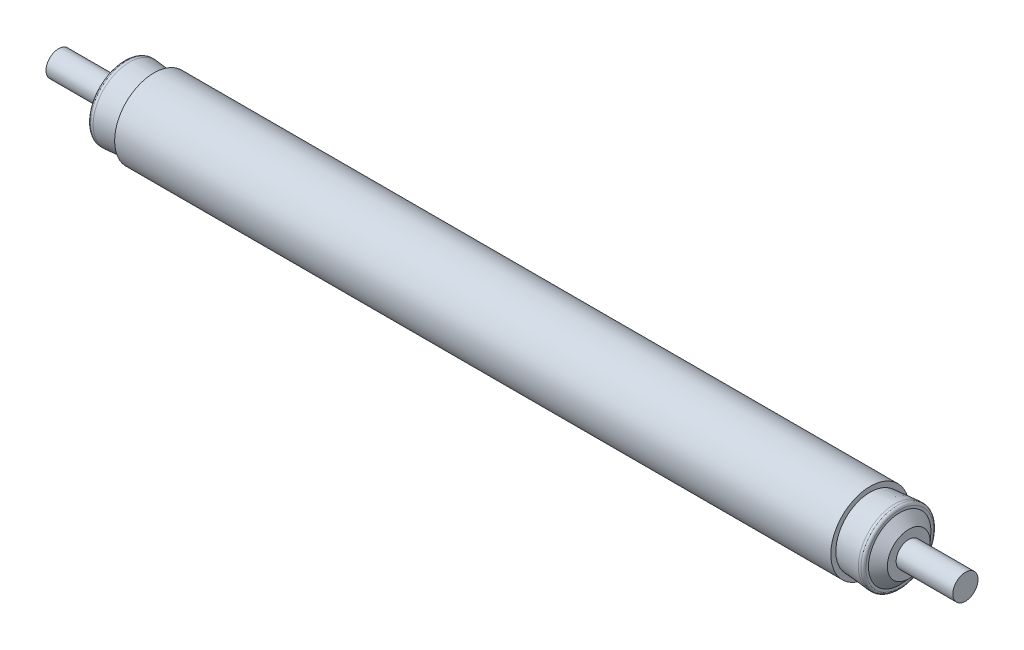
ISO-10303-21;
HEADER;
FILE_DESCRIPTION(('STEP AP214'),'2;1');
FILE_NAME('part.step','',(''),(''),'','','');
FILE_SCHEMA(('AUTOMOTIVE_DESIGN { 1 0 10303 214 1 1 1 1 }'));
ENDSEC;
DATA;
#1=APPLICATION_CONTEXT('core data for automotive mechanical design processes');
#2=APPLICATION_PROTOCOL_DEFINITION('international standard','automotive_design',2000,#1);
#3=PRODUCT_CONTEXT('',#1,'mechanical');
#4=PRODUCT('Part','Part','',(#3));
#5=PRODUCT_RELATED_PRODUCT_CATEGORY('part','',(#4));
#6=PRODUCT_DEFINITION_FORMATION('','',#4);
#7=PRODUCT_DEFINITION_CONTEXT('part definition',#1,'design');
#8=PRODUCT_DEFINITION('design','',#6,#7);
#9=PRODUCT_DEFINITION_SHAPE('','',#8);
#10=(LENGTH_UNIT() NAMED_UNIT(*) SI_UNIT(.MILLI.,.METRE.));
#11=(NAMED_UNIT(*) PLANE_ANGLE_UNIT() SI_UNIT($,.RADIAN.));
#12=(NAMED_UNIT(*) SI_UNIT($,.STERADIAN.) SOLID_ANGLE_UNIT());
#13=UNCERTAINTY_MEASURE_WITH_UNIT(LENGTH_MEASURE(1.E-05),#10,'distance_accuracy_value','');
#14=(GEOMETRIC_REPRESENTATION_CONTEXT(3) GLOBAL_UNCERTAINTY_ASSIGNED_CONTEXT((#13)) GLOBAL_UNIT_ASSIGNED_CONTEXT((#10,
#11,#12)) REPRESENTATION_CONTEXT('',''));
#15=CARTESIAN_POINT('',(0.,0.,0.));
#16=DIRECTION('',(0.,0.,1.));
#17=DIRECTION('',(1.,0.,0.));
#18=AXIS2_PLACEMENT_3D('',#15,#16,#17);
#19=CARTESIAN_POINT('',(114.3,-3.17499999999999,0.));
#20=DIRECTION('',(-1.,0.,0.));
#21=DIRECTION('',(0.,0.,1.));
#22=AXIS2_PLACEMENT_3D('',#19,#20,#21);
#23=PLANE('',#22);
#24=CARTESIAN_POINT('',(114.3,0.,0.));
#25=DIRECTION('',(-1.,0.,0.));
#26=DIRECTION('',(0.,0.,1.));
#27=AXIS2_PLACEMENT_3D('',#24,#25,#26);
#28=CIRCLE('',#27,3.17499999999998);
#29=CARTESIAN_POINT('',(114.3,0.,3.17499999999998));
#30=VERTEX_POINT('',#29);
#31=EDGE_CURVE('E237',#30,#30,#28,.T.);
#32=ORIENTED_EDGE('',*,*,#31,.F.);
#33=EDGE_LOOP('',(#32));
#34=FACE_BOUND('',#33,.T.);
#35=ADVANCED_FACE('F18',(#34),#23,.F.);
#36=CARTESIAN_POINT('',(-114.3,0.,0.));
#37=DIRECTION('',(1.,0.,0.));
#38=DIRECTION('',(0.,0.,-1.));
#39=AXIS2_PLACEMENT_3D('',#36,#37,#38);
#40=PLANE('',#39);
#41=CARTESIAN_POINT('',(-114.3,0.,0.));
#42=DIRECTION('',(-1.,0.,0.));
#43=DIRECTION('',(0.,0.,1.));
#44=AXIS2_PLACEMENT_3D('',#41,#42,#43);
#45=CIRCLE('',#44,3.17499999999998);
#46=CARTESIAN_POINT('',(-114.3,0.,3.17499999999998));
#47=VERTEX_POINT('',#46);
#48=EDGE_CURVE('E247',#47,#47,#45,.F.);
#49=ORIENTED_EDGE('',*,*,#48,.F.);
#50=EDGE_LOOP('',(#49));
#51=FACE_BOUND('',#50,.T.);
#52=ADVANCED_FACE('F156',(#51),#40,.F.);
#53=CARTESIAN_POINT('',(-114.3,0.,0.));
#54=DIRECTION('',(-1.,0.,0.));
#55=DIRECTION('',(0.,0.,1.));
#56=AXIS2_PLACEMENT_3D('',#53,#54,#55);
#57=CYLINDRICAL_SURFACE('',#56,3.17499999999998);
#58=CARTESIAN_POINT('',(100.0125,0.,0.));
#59=DIRECTION('',(-1.,0.,0.));
#60=DIRECTION('',(0.,0.,1.));
#61=AXIS2_PLACEMENT_3D('',#58,#59,#60);
#62=CIRCLE('',#61,3.17499999999998);
#63=CARTESIAN_POINT('',(100.0125,0.,3.17499999999998));
#64=VERTEX_POINT('',#63);
#65=EDGE_CURVE('E251',#64,#64,#62,.F.);
#66=ORIENTED_EDGE('',*,*,#65,.T.);
#67=EDGE_LOOP('',(#66));
#68=FACE_BOUND('',#67,.T.);
#69=ORIENTED_EDGE('',*,*,#31,.T.);
#70=EDGE_LOOP('',(#69));
#71=FACE_BOUND('',#70,.T.);
#72=ADVANCED_FACE('F153',(#68,#71),#57,.T.);
#73=CARTESIAN_POINT('',(-114.3,0.,0.));
#74=DIRECTION('',(-1.,0.,0.));
#75=DIRECTION('',(0.,0.,1.));
#76=AXIS2_PLACEMENT_3D('',#73,#74,#75);
#77=CYLINDRICAL_SURFACE('',#76,3.17499999999998);
#78=ORIENTED_EDGE('',*,*,#48,.T.);
#79=EDGE_LOOP('',(#78));
#80=FACE_BOUND('',#79,.T.);
#81=CARTESIAN_POINT('',(-100.0125,0.,0.));
#82=DIRECTION('',(-1.,0.,0.));
#83=DIRECTION('',(0.,0.,1.));
#84=AXIS2_PLACEMENT_3D('',#81,#82,#83);
#85=CIRCLE('',#84,3.17499999999998);
#86=CARTESIAN_POINT('',(-100.0125,0.,3.17499999999998));
#87=VERTEX_POINT('',#86);
#88=EDGE_CURVE('E254',#87,#87,#85,.T.);
#89=ORIENTED_EDGE('',*,*,#88,.T.);
#90=EDGE_LOOP('',(#89));
#91=FACE_BOUND('',#90,.T.);
#92=ADVANCED_FACE('F149',(#80,#91),#77,.T.);
#93=CARTESIAN_POINT('',(100.0125,-3.17499999999999,0.));
#94=DIRECTION('',(-1.,0.,0.));
#95=DIRECTION('',(0.,0.,1.));
#96=AXIS2_PLACEMENT_3D('',#93,#94,#95);
#97=PLANE('',#96);
#98=ORIENTED_EDGE('',*,*,#65,.F.);
#99=EDGE_LOOP('',(#98));
#100=FACE_BOUND('',#99,.T.);
#101=CARTESIAN_POINT('',(100.012499999996,0.,0.));
#102=DIRECTION('',(-1.,0.,0.));
#103=DIRECTION('',(0.,-1.,0.));
#104=AXIS2_PLACEMENT_3D('',#101,#102,#103);
#105=CIRCLE('',#104,5.39750000001504);
#106=CARTESIAN_POINT('',(100.012499999996,-5.39750000001505,0.));
#107=VERTEX_POINT('',#106);
#108=EDGE_CURVE('E258',#107,#107,#105,.T.);
#109=ORIENTED_EDGE('',*,*,#108,.F.);
#110=EDGE_LOOP('',(#109));
#111=FACE_BOUND('',#110,.T.);
#112=ADVANCED_FACE('F145',(#100,#111),#97,.F.);
#113=CARTESIAN_POINT('',(-100.0125,-3.17499999999999,0.));
#114=DIRECTION('',(1.,0.,0.));
#115=DIRECTION('',(0.,0.,-1.));
#116=AXIS2_PLACEMENT_3D('',#113,#114,#115);
#117=PLANE('',#116);
#118=CARTESIAN_POINT('',(-100.0125,0.,0.));
#119=DIRECTION('',(1.,0.,0.));
#120=DIRECTION('',(0.,1.,0.));
#121=AXIS2_PLACEMENT_3D('',#118,#119,#120);
#122=CIRCLE('',#121,5.39749999999999);
#123=CARTESIAN_POINT('',(-100.0125,5.39749999999998,0.));
#124=VERTEX_POINT('',#123);
#125=EDGE_CURVE('E262',#124,#124,#122,.T.);
#126=ORIENTED_EDGE('',*,*,#125,.F.);
#127=EDGE_LOOP('',(#126));
#128=FACE_BOUND('',#127,.T.);
#129=ORIENTED_EDGE('',*,*,#88,.F.);
#130=EDGE_LOOP('',(#129));
#131=FACE_BOUND('',#130,.T.);
#132=ADVANCED_FACE('F141',(#128,#131),#117,.F.);
#133=CARTESIAN_POINT('',(97.7265000000784,0.,0.));
#134=DIRECTION('',(-1.,0.,0.));
#135=DIRECTION('',(0.,-1.,0.));
#136=AXIS2_PLACEMENT_3D('',#133,#134,#135);
#137=CONICAL_SURFACE('',#136,7.87399999990157,0.825376850515972);
#138=CARTESIAN_POINT('',(97.726500000026,0.,0.));
#139=DIRECTION('',(-1.,0.,0.));
#140=DIRECTION('',(0.,-1.,0.));
#141=AXIS2_PLACEMENT_3D('',#138,#139,#140);
#142=CIRCLE('',#141,7.87399999995841);
#143=CARTESIAN_POINT('',(97.726500000026,-7.87399999995842,0.));
#144=VERTEX_POINT('',#143);
#145=EDGE_CURVE('E266',#144,#144,#142,.F.);
#146=ORIENTED_EDGE('',*,*,#145,.T.);
#147=EDGE_LOOP('',(#146));
#148=FACE_BOUND('',#147,.T.);
#149=ORIENTED_EDGE('',*,*,#108,.T.);
#150=EDGE_LOOP('',(#149));
#151=FACE_BOUND('',#150,.T.);
#152=ADVANCED_FACE('F137',(#148,#151),#137,.T.);
#153=CARTESIAN_POINT('',(-97.7265,0.,0.));
#154=DIRECTION('',(1.,0.,0.));
#155=DIRECTION('',(0.,1.,0.));
#156=AXIS2_PLACEMENT_3D('',#153,#154,#155);
#157=CONICAL_SURFACE('',#156,7.87399999999999,0.825376850520736);
#158=ORIENTED_EDGE('',*,*,#125,.T.);
#159=EDGE_LOOP('',(#158));
#160=FACE_BOUND('',#159,.T.);
#161=CARTESIAN_POINT('',(-97.7265,0.,0.));
#162=DIRECTION('',(1.,0.,0.));
#163=DIRECTION('',(0.,1.,0.));
#164=AXIS2_PLACEMENT_3D('',#161,#162,#163);
#165=CIRCLE('',#164,7.87399999999999);
#166=CARTESIAN_POINT('',(-97.7265,7.87399999999998,0.));
#167=VERTEX_POINT('',#166);
#168=EDGE_CURVE('E60',#167,#167,#165,.F.);
#169=ORIENTED_EDGE('',*,*,#168,.T.);
#170=EDGE_LOOP('',(#169));
#171=FACE_BOUND('',#170,.T.);
#172=ADVANCED_FACE('F132',(#160,#171),#157,.T.);
#173=CARTESIAN_POINT('',(97.7265,-7.874,0.));
#174=DIRECTION('',(-1.,0.,0.));
#175=DIRECTION('',(0.,0.,1.));
#176=AXIS2_PLACEMENT_3D('',#173,#174,#175);
#177=PLANE('',#176);
#178=ORIENTED_EDGE('',*,*,#145,.F.);
#179=EDGE_LOOP('',(#178));
#180=FACE_BOUND('',#179,.T.);
#181=CARTESIAN_POINT('',(97.7265,0.,0.));
#182=DIRECTION('',(-1.,0.,0.));
#183=DIRECTION('',(0.,0.,-1.));
#184=AXIS2_PLACEMENT_3D('',#181,#182,#183);
#185=CIRCLE('',#184,8.50899999999999);
#186=CARTESIAN_POINT('',(97.7265,0.,-8.50899999999999));
#187=VERTEX_POINT('',#186);
#188=CARTESIAN_POINT('',(97.7265,0.,8.50899999999999));
#189=VERTEX_POINT('',#188);
#190=EDGE_CURVE('E57',#187,#189,#185,.T.);
#191=ORIENTED_EDGE('',*,*,#190,.F.);
#192=CARTESIAN_POINT('',(97.7265,0.,0.));
#193=DIRECTION('',(-1.,0.,0.));
#194=DIRECTION('',(0.,0.,1.));
#195=AXIS2_PLACEMENT_3D('',#192,#193,#194);
#196=CIRCLE('',#195,8.50899999999999);
#197=EDGE_CURVE('E52',#189,#187,#196,.T.);
#198=ORIENTED_EDGE('',*,*,#197,.F.);
#199=EDGE_LOOP('',(#191,#198));
#200=FACE_BOUND('',#199,.T.);
#201=ADVANCED_FACE('F56',(#180,#200),#177,.F.);
#202=CARTESIAN_POINT('',(-97.7265,-7.874,0.));
#203=DIRECTION('',(1.,0.,0.));
#204=DIRECTION('',(0.,0.,-1.));
#205=AXIS2_PLACEMENT_3D('',#202,#203,#204);
#206=PLANE('',#205);
#207=CARTESIAN_POINT('',(-97.7265,0.,0.));
#208=DIRECTION('',(1.,0.,0.));
#209=DIRECTION('',(0.,0.,1.));
#210=AXIS2_PLACEMENT_3D('',#207,#208,#209);
#211=CIRCLE('',#210,8.50899999999999);
#212=CARTESIAN_POINT('',(-97.7265,0.,8.50899999999999));
#213=VERTEX_POINT('',#212);
#214=CARTESIAN_POINT('',(-97.7265,0.,-8.50899999999999));
#215=VERTEX_POINT('',#214);
#216=EDGE_CURVE('E41',#213,#215,#211,.T.);
#217=ORIENTED_EDGE('',*,*,#216,.F.);
#218=CARTESIAN_POINT('',(-97.7265,0.,0.));
#219=DIRECTION('',(1.,0.,0.));
#220=DIRECTION('',(0.,0.,-1.));
#221=AXIS2_PLACEMENT_3D('',#218,#219,#220);
#222=CIRCLE('',#221,8.50899999999999);
#223=EDGE_CURVE('E104',#215,#213,#222,.T.);
#224=ORIENTED_EDGE('',*,*,#223,.F.);
#225=EDGE_LOOP('',(#217,#224));
#226=FACE_BOUND('',#225,.T.);
#227=ORIENTED_EDGE('',*,*,#168,.F.);
#228=EDGE_LOOP('',(#227));
#229=FACE_BOUND('',#228,.T.);
#230=ADVANCED_FACE('F85',(#226,#229),#206,.F.);
#231=CARTESIAN_POINT('',(97.0915,0.,0.));
#232=DIRECTION('',(-1.,0.,0.));
#233=DIRECTION('',(0.,0.,1.));
#234=AXIS2_PLACEMENT_3D('',#231,#232,#233);
#235=TOROIDAL_SURFACE('',#234,8.50899999999999,0.634999999999998);
#236=ORIENTED_EDGE('',*,*,#197,.T.);
#237=ORIENTED_EDGE('',*,*,#190,.T.);
#238=EDGE_LOOP('',(#236,#237));
#239=FACE_BOUND('',#238,.T.);
#240=CARTESIAN_POINT('',(97.0915,0.,0.));
#241=DIRECTION('',(-1.,0.,0.));
#242=DIRECTION('',(0.,0.,1.));
#243=AXIS2_PLACEMENT_3D('',#240,#241,#242);
#244=CIRCLE('',#243,9.14399999999999);
#245=CARTESIAN_POINT('',(97.0915,0.,9.14399999999999));
#246=VERTEX_POINT('',#245);
#247=EDGE_CURVE('E93',#246,#246,#244,.T.);
#248=ORIENTED_EDGE('',*,*,#247,.F.);
#249=EDGE_LOOP('',(#248));
#250=FACE_BOUND('',#249,.T.);
#251=ADVANCED_FACE('F64',(#239,#250),#235,.T.);
#252=CARTESIAN_POINT('',(-97.0915,0.,0.));
#253=DIRECTION('',(-1.,0.,0.));
#254=DIRECTION('',(0.,0.,1.));
#255=AXIS2_PLACEMENT_3D('',#252,#253,#254);
#256=TOROIDAL_SURFACE('',#255,8.50899999999999,0.634999999999998);
#257=ORIENTED_EDGE('',*,*,#216,.T.);
#258=ORIENTED_EDGE('',*,*,#223,.T.);
#259=EDGE_LOOP('',(#257,#258));
#260=FACE_BOUND('',#259,.T.);
#261=CARTESIAN_POINT('',(-97.0915,0.,0.));
#262=DIRECTION('',(-1.,0.,0.));
#263=DIRECTION('',(0.,0.,1.));
#264=AXIS2_PLACEMENT_3D('',#261,#262,#263);
#265=CIRCLE('',#264,9.14399999999999);
#266=CARTESIAN_POINT('',(-97.0915,0.,9.14399999999999));
#267=VERTEX_POINT('',#266);
#268=EDGE_CURVE('E208',#267,#267,#265,.F.);
#269=ORIENTED_EDGE('',*,*,#268,.F.);
#270=EDGE_LOOP('',(#269));
#271=FACE_BOUND('',#270,.T.);
#272=ADVANCED_FACE('F84',(#260,#271),#256,.T.);
#273=CARTESIAN_POINT('',(-114.3,0.,0.));
#274=DIRECTION('',(-1.,0.,0.));
#275=DIRECTION('',(0.,0.,1.));
#276=AXIS2_PLACEMENT_3D('',#273,#274,#275);
#277=CYLINDRICAL_SURFACE('',#276,9.14399999999999);
#278=ORIENTED_EDGE('',*,*,#247,.T.);
#279=EDGE_LOOP('',(#278));
#280=FACE_BOUND('',#279,.T.);
#281=CARTESIAN_POINT('',(96.4565,0.,0.));
#282=DIRECTION('',(1.,0.,0.));
#283=DIRECTION('',(0.,0.,-1.));
#284=AXIS2_PLACEMENT_3D('',#281,#282,#283);
#285=CIRCLE('',#284,9.14399999999999);
#286=CARTESIAN_POINT('',(96.4565,0.,-9.14399999999999));
#287=VERTEX_POINT('',#286);
#288=EDGE_CURVE('E204',#287,#287,#285,.F.);
#289=ORIENTED_EDGE('',*,*,#288,.F.);
#290=EDGE_LOOP('',(#289));
#291=FACE_BOUND('',#290,.T.);
#292=ADVANCED_FACE('F192',(#280,#291),#277,.T.);
#293=CARTESIAN_POINT('',(-114.3,0.,0.));
#294=DIRECTION('',(-1.,0.,0.));
#295=DIRECTION('',(0.,0.,1.));
#296=AXIS2_PLACEMENT_3D('',#293,#294,#295);
#297=CYLINDRICAL_SURFACE('',#296,9.14399999999999);
#298=ORIENTED_EDGE('',*,*,#268,.T.);
#299=EDGE_LOOP('',(#298));
#300=FACE_BOUND('',#299,.T.);
#301=CARTESIAN_POINT('',(-96.4565,0.,0.));
#302=DIRECTION('',(-1.,0.,0.));
#303=DIRECTION('',(0.,0.,1.));
#304=AXIS2_PLACEMENT_3D('',#301,#302,#303);
#305=CIRCLE('',#304,9.14399999999999);
#306=CARTESIAN_POINT('',(-96.4565,0.,9.14399999999999));
#307=VERTEX_POINT('',#306);
#308=EDGE_CURVE('E207',#307,#307,#305,.F.);
#309=ORIENTED_EDGE('',*,*,#308,.F.);
#310=EDGE_LOOP('',(#309));
#311=FACE_BOUND('',#310,.T.);
#312=ADVANCED_FACE('F189',(#300,#311),#297,.T.);
#313=CARTESIAN_POINT('',(96.4565,0.,0.));
#314=DIRECTION('',(1.,0.,0.));
#315=DIRECTION('',(0.,1.,0.));
#316=AXIS2_PLACEMENT_3D('',#313,#314,#315);
#317=CONICAL_SURFACE('',#316,9.14399999999999,0.081951565556419);
#318=CARTESIAN_POINT('',(90.2716,0.,0.));
#319=DIRECTION('',(1.,0.,0.));
#320=DIRECTION('',(0.,1.,0.));
#321=AXIS2_PLACEMENT_3D('',#318,#319,#320);
#322=CIRCLE('',#321,8.63599999999999);
#323=CARTESIAN_POINT('',(90.2716,8.63599999999998,0.));
#324=VERTEX_POINT('',#323);
#325=EDGE_CURVE('E215',#324,#324,#322,.T.);
#326=ORIENTED_EDGE('',*,*,#325,.T.);
#327=EDGE_LOOP('',(#326));
#328=FACE_BOUND('',#327,.T.);
#329=ORIENTED_EDGE('',*,*,#288,.T.);
#330=EDGE_LOOP('',(#329));
#331=FACE_BOUND('',#330,.T.);
#332=ADVANCED_FACE('F185',(#328,#331),#317,.T.);
#333=CARTESIAN_POINT('',(-96.4565,0.,0.));
#334=DIRECTION('',(-1.,0.,0.));
#335=DIRECTION('',(0.,-1.,0.));
#336=AXIS2_PLACEMENT_3D('',#333,#334,#335);
#337=CONICAL_SURFACE('',#336,9.14399999999999,0.081951565556419);
#338=ORIENTED_EDGE('',*,*,#308,.T.);
#339=EDGE_LOOP('',(#338));
#340=FACE_BOUND('',#339,.T.);
#341=CARTESIAN_POINT('',(-90.2716,0.,0.));
#342=DIRECTION('',(-1.,0.,0.));
#343=DIRECTION('',(0.,-1.,0.));
#344=AXIS2_PLACEMENT_3D('',#341,#342,#343);
#345=CIRCLE('',#344,8.63599999999999);
#346=CARTESIAN_POINT('',(-90.2716,-8.636,0.));
#347=VERTEX_POINT('',#346);
#348=EDGE_CURVE('E275',#347,#347,#345,.T.);
#349=ORIENTED_EDGE('',*,*,#348,.T.);
#350=EDGE_LOOP('',(#349));
#351=FACE_BOUND('',#350,.T.);
#352=ADVANCED_FACE('F181',(#340,#351),#337,.T.);
#353=CARTESIAN_POINT('',(90.2716,-8.636,0.));
#354=DIRECTION('',(-1.,0.,0.));
#355=DIRECTION('',(0.,0.,1.));
#356=AXIS2_PLACEMENT_3D('',#353,#354,#355);
#357=PLANE('',#356);
#358=ORIENTED_EDGE('',*,*,#325,.F.);
#359=EDGE_LOOP('',(#358));
#360=FACE_BOUND('',#359,.T.);
#361=CARTESIAN_POINT('',(90.2716,0.,0.));
#362=DIRECTION('',(-1.,0.,0.));
#363=DIRECTION('',(0.,0.,1.));
#364=AXIS2_PLACEMENT_3D('',#361,#362,#363);
#365=CIRCLE('',#364,9.90599999999999);
#366=CARTESIAN_POINT('',(90.2716,0.,9.90599999999999));
#367=VERTEX_POINT('',#366);
#368=EDGE_CURVE('E30',#367,#367,#365,.T.);
#369=ORIENTED_EDGE('',*,*,#368,.F.);
#370=EDGE_LOOP('',(#369));
#371=FACE_BOUND('',#370,.T.);
#372=ADVANCED_FACE('F174',(#360,#371),#357,.F.);
#373=CARTESIAN_POINT('',(-90.2716,-8.636,0.));
#374=DIRECTION('',(1.,0.,0.));
#375=DIRECTION('',(0.,0.,-1.));
#376=AXIS2_PLACEMENT_3D('',#373,#374,#375);
#377=PLANE('',#376);
#378=CARTESIAN_POINT('',(-90.2716,0.,0.));
#379=DIRECTION('',(-1.,0.,0.));
#380=DIRECTION('',(0.,0.,1.));
#381=AXIS2_PLACEMENT_3D('',#378,#379,#380);
#382=CIRCLE('',#381,9.90599999999999);
#383=CARTESIAN_POINT('',(-90.2716,0.,9.90599999999999));
#384=VERTEX_POINT('',#383);
#385=EDGE_CURVE('E11',#384,#384,#382,.F.);
#386=ORIENTED_EDGE('',*,*,#385,.F.);
#387=EDGE_LOOP('',(#386));
#388=FACE_BOUND('',#387,.T.);
#389=ORIENTED_EDGE('',*,*,#348,.F.);
#390=EDGE_LOOP('',(#389));
#391=FACE_BOUND('',#390,.T.);
#392=ADVANCED_FACE('F168',(#388,#391),#377,.F.);
#393=CARTESIAN_POINT('',(-114.3,0.,0.));
#394=DIRECTION('',(-1.,0.,0.));
#395=DIRECTION('',(0.,0.,1.));
#396=AXIS2_PLACEMENT_3D('',#393,#394,#395);
#397=CYLINDRICAL_SURFACE('',#396,9.90599999999999);
#398=ORIENTED_EDGE('',*,*,#385,.T.);
#399=EDGE_LOOP('',(#398));
#400=FACE_BOUND('',#399,.T.);
#401=ORIENTED_EDGE('',*,*,#368,.T.);
#402=EDGE_LOOP('',(#401));
#403=FACE_BOUND('',#402,.T.);
#404=ADVANCED_FACE('F166',(#400,#403),#397,.T.);
#405=CLOSED_SHELL('',(#35,#52,#72,#92,#112,#132,#152,#172,#201,#230,#251,#272,#292,#312,#332,
#352,#372,#392,#404));
#406=MANIFOLD_SOLID_BREP('B1',#405);
#407=ADVANCED_BREP_SHAPE_REPRESENTATION('',(#18,#406),#14);
#408=SHAPE_DEFINITION_REPRESENTATION(#9,#407);
ENDSEC;
END-ISO-10303-21;
